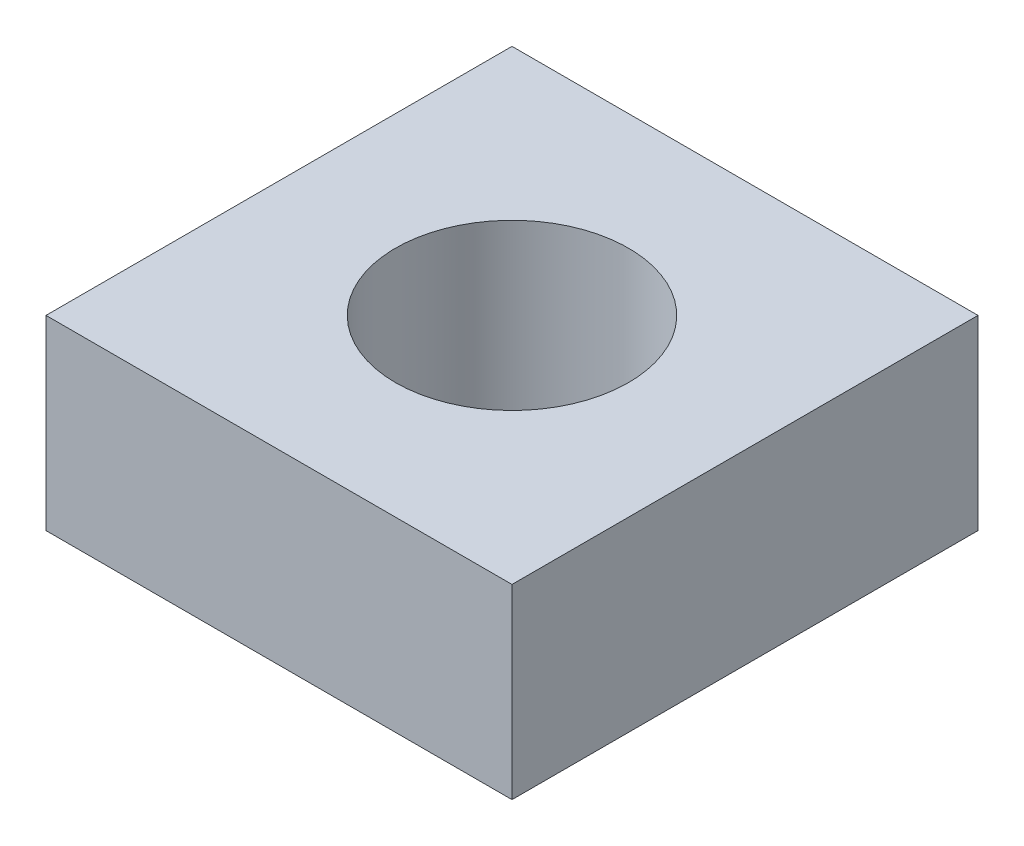
ISO-10303-21;
HEADER;
FILE_DESCRIPTION(('STEP AP214'),'2;1');
FILE_NAME('part.step','',(''),(''),'','','');
FILE_SCHEMA(('AUTOMOTIVE_DESIGN { 1 0 10303 214 1 1 1 1 }'));
ENDSEC;
DATA;
#1=APPLICATION_CONTEXT('core data for automotive mechanical design processes');
#2=APPLICATION_PROTOCOL_DEFINITION('international standard','automotive_design',2000,#1);
#3=PRODUCT_CONTEXT('',#1,'mechanical');
#4=PRODUCT('Part','Part','',(#3));
#5=PRODUCT_RELATED_PRODUCT_CATEGORY('part','',(#4));
#6=PRODUCT_DEFINITION_FORMATION('','',#4);
#7=PRODUCT_DEFINITION_CONTEXT('part definition',#1,'design');
#8=PRODUCT_DEFINITION('design','',#6,#7);
#9=PRODUCT_DEFINITION_SHAPE('','',#8);
#10=(LENGTH_UNIT() NAMED_UNIT(*) SI_UNIT(.MILLI.,.METRE.));
#11=(NAMED_UNIT(*) PLANE_ANGLE_UNIT() SI_UNIT($,.RADIAN.));
#12=(NAMED_UNIT(*) SI_UNIT($,.STERADIAN.) SOLID_ANGLE_UNIT());
#13=UNCERTAINTY_MEASURE_WITH_UNIT(LENGTH_MEASURE(1.E-05),#10,'distance_accuracy_value','');
#14=(GEOMETRIC_REPRESENTATION_CONTEXT(3) GLOBAL_UNCERTAINTY_ASSIGNED_CONTEXT((#13)) GLOBAL_UNIT_ASSIGNED_CONTEXT((#10,
#11,#12)) REPRESENTATION_CONTEXT('',''));
#15=CARTESIAN_POINT('',(0.,0.,0.));
#16=DIRECTION('',(0.,0.,1.));
#17=DIRECTION('',(1.,0.,0.));
#18=AXIS2_PLACEMENT_3D('',#15,#16,#17);
#19=CARTESIAN_POINT('',(0.,20.,0.));
#20=DIRECTION('',(0.,-1.,0.));
#21=DIRECTION('',(0.,0.,-1.));
#22=AXIS2_PLACEMENT_3D('',#19,#20,#21);
#23=PLANE('',#22);
#24=DIRECTION('',(0.,0.,-1.));
#25=VECTOR('',#24,1.);
#26=CARTESIAN_POINT('',(25.,20.,25.));
#27=LINE('',#26,#25);
#28=CARTESIAN_POINT('',(25.,20.,25.));
#29=VERTEX_POINT('',#28);
#30=CARTESIAN_POINT('',(25.,20.,-25.));
#31=VERTEX_POINT('',#30);
#32=EDGE_CURVE('E85',#29,#31,#27,.T.);
#33=ORIENTED_EDGE('',*,*,#32,.T.);
#34=DIRECTION('',(-1.,0.,0.));
#35=VECTOR('',#34,1.);
#36=CARTESIAN_POINT('',(-25.,20.,-25.));
#37=LINE('',#36,#35);
#38=CARTESIAN_POINT('',(-25.,20.,-25.));
#39=VERTEX_POINT('',#38);
#40=EDGE_CURVE('E80',#31,#39,#37,.T.);
#41=ORIENTED_EDGE('',*,*,#40,.T.);
#42=DIRECTION('',(0.,0.,1.));
#43=VECTOR('',#42,1.);
#44=CARTESIAN_POINT('',(-25.,20.,25.));
#45=LINE('',#44,#43);
#46=CARTESIAN_POINT('',(-25.,20.,25.));
#47=VERTEX_POINT('',#46);
#48=EDGE_CURVE('E83',#39,#47,#45,.T.);
#49=ORIENTED_EDGE('',*,*,#48,.T.);
#50=DIRECTION('',(1.,0.,0.));
#51=VECTOR('',#50,1.);
#52=CARTESIAN_POINT('',(-25.,20.,25.));
#53=LINE('',#52,#51);
#54=EDGE_CURVE('E50',#47,#29,#53,.T.);
#55=ORIENTED_EDGE('',*,*,#54,.T.);
#56=EDGE_LOOP('',(#33,#41,#49,#55));
#57=FACE_BOUND('',#56,.T.);
#58=CARTESIAN_POINT('',(0.,20.,0.));
#59=DIRECTION('',(0.,1.,0.));
#60=DIRECTION('',(0.,0.,1.));
#61=AXIS2_PLACEMENT_3D('',#58,#59,#60);
#62=CIRCLE('',#61,12.5);
#63=CARTESIAN_POINT('',(0.,20.,12.5));
#64=VERTEX_POINT('',#63);
#65=EDGE_CURVE('E100',#64,#64,#62,.T.);
#66=ORIENTED_EDGE('',*,*,#65,.F.);
#67=EDGE_LOOP('',(#66));
#68=FACE_BOUND('',#67,.T.);
#69=ADVANCED_FACE('F33',(#57,#68),#23,.F.);
#70=CARTESIAN_POINT('',(0.,0.,0.));
#71=DIRECTION('',(0.,-1.,0.));
#72=DIRECTION('',(0.,0.,-1.));
#73=AXIS2_PLACEMENT_3D('',#70,#71,#72);
#74=PLANE('',#73);
#75=DIRECTION('',(0.,0.,-1.));
#76=VECTOR('',#75,1.);
#77=CARTESIAN_POINT('',(25.,0.,25.));
#78=LINE('',#77,#76);
#79=CARTESIAN_POINT('',(25.,0.,25.));
#80=VERTEX_POINT('',#79);
#81=CARTESIAN_POINT('',(25.,0.,-25.));
#82=VERTEX_POINT('',#81);
#83=EDGE_CURVE('E97',#80,#82,#78,.T.);
#84=ORIENTED_EDGE('',*,*,#83,.F.);
#85=DIRECTION('',(1.,0.,0.));
#86=VECTOR('',#85,1.);
#87=CARTESIAN_POINT('',(-25.,0.,25.));
#88=LINE('',#87,#86);
#89=CARTESIAN_POINT('',(-25.,0.,25.));
#90=VERTEX_POINT('',#89);
#91=EDGE_CURVE('E73',#90,#80,#88,.T.);
#92=ORIENTED_EDGE('',*,*,#91,.F.);
#93=DIRECTION('',(0.,0.,1.));
#94=VECTOR('',#93,1.);
#95=CARTESIAN_POINT('',(-25.,0.,25.));
#96=LINE('',#95,#94);
#97=CARTESIAN_POINT('',(-25.,0.,-25.));
#98=VERTEX_POINT('',#97);
#99=EDGE_CURVE('E67',#98,#90,#96,.T.);
#100=ORIENTED_EDGE('',*,*,#99,.F.);
#101=DIRECTION('',(-1.,0.,0.));
#102=VECTOR('',#101,1.);
#103=CARTESIAN_POINT('',(-25.,0.,-25.));
#104=LINE('',#103,#102);
#105=EDGE_CURVE('E89',#82,#98,#104,.T.);
#106=ORIENTED_EDGE('',*,*,#105,.F.);
#107=EDGE_LOOP('',(#84,#92,#100,#106));
#108=FACE_BOUND('',#107,.T.);
#109=CARTESIAN_POINT('',(0.,0.,0.));
#110=DIRECTION('',(0.,1.,0.));
#111=DIRECTION('',(0.,0.,1.));
#112=AXIS2_PLACEMENT_3D('',#109,#110,#111);
#113=CIRCLE('',#112,12.5);
#114=CARTESIAN_POINT('',(0.,0.,12.5));
#115=VERTEX_POINT('',#114);
#116=EDGE_CURVE('E112',#115,#115,#113,.T.);
#117=ORIENTED_EDGE('',*,*,#116,.T.);
#118=EDGE_LOOP('',(#117));
#119=FACE_BOUND('',#118,.T.);
#120=ADVANCED_FACE('F108',(#108,#119),#74,.T.);
#121=CARTESIAN_POINT('',(25.,20.,25.));
#122=DIRECTION('',(-1.,0.,0.));
#123=DIRECTION('',(0.,0.,1.));
#124=AXIS2_PLACEMENT_3D('',#121,#122,#123);
#125=PLANE('',#124);
#126=ORIENTED_EDGE('',*,*,#83,.T.);
#127=DIRECTION('',(0.,-1.,0.));
#128=VECTOR('',#127,1.);
#129=CARTESIAN_POINT('',(25.,20.,-25.));
#130=LINE('',#129,#128);
#131=EDGE_CURVE('E11',#31,#82,#130,.T.);
#132=ORIENTED_EDGE('',*,*,#131,.F.);
#133=ORIENTED_EDGE('',*,*,#32,.F.);
#134=DIRECTION('',(0.,-1.,0.));
#135=VECTOR('',#134,1.);
#136=CARTESIAN_POINT('',(25.,20.,25.));
#137=LINE('',#136,#135);
#138=EDGE_CURVE('E93',#29,#80,#137,.T.);
#139=ORIENTED_EDGE('',*,*,#138,.T.);
#140=EDGE_LOOP('',(#126,#132,#133,#139));
#141=FACE_BOUND('',#140,.T.);
#142=ADVANCED_FACE('F35',(#141),#125,.F.);
#143=CARTESIAN_POINT('',(-25.,20.,-25.));
#144=DIRECTION('',(0.,0.,1.));
#145=DIRECTION('',(1.,0.,0.));
#146=AXIS2_PLACEMENT_3D('',#143,#144,#145);
#147=PLANE('',#146);
#148=ORIENTED_EDGE('',*,*,#105,.T.);
#149=DIRECTION('',(0.,-1.,0.));
#150=VECTOR('',#149,1.);
#151=CARTESIAN_POINT('',(-25.,20.,-25.));
#152=LINE('',#151,#150);
#153=EDGE_CURVE('E42',#39,#98,#152,.T.);
#154=ORIENTED_EDGE('',*,*,#153,.F.);
#155=ORIENTED_EDGE('',*,*,#40,.F.);
#156=ORIENTED_EDGE('',*,*,#131,.T.);
#157=EDGE_LOOP('',(#148,#154,#155,#156));
#158=FACE_BOUND('',#157,.T.);
#159=ADVANCED_FACE('F88',(#158),#147,.F.);
#160=CARTESIAN_POINT('',(-25.,20.,25.));
#161=DIRECTION('',(1.,0.,0.));
#162=DIRECTION('',(0.,0.,-1.));
#163=AXIS2_PLACEMENT_3D('',#160,#161,#162);
#164=PLANE('',#163);
#165=ORIENTED_EDGE('',*,*,#99,.T.);
#166=DIRECTION('',(0.,-1.,0.));
#167=VECTOR('',#166,1.);
#168=CARTESIAN_POINT('',(-25.,20.,25.));
#169=LINE('',#168,#167);
#170=EDGE_CURVE('E90',#47,#90,#169,.T.);
#171=ORIENTED_EDGE('',*,*,#170,.F.);
#172=ORIENTED_EDGE('',*,*,#48,.F.);
#173=ORIENTED_EDGE('',*,*,#153,.T.);
#174=EDGE_LOOP('',(#165,#171,#172,#173));
#175=FACE_BOUND('',#174,.T.);
#176=ADVANCED_FACE('F91',(#175),#164,.F.);
#177=CARTESIAN_POINT('',(-25.,20.,25.));
#178=DIRECTION('',(0.,0.,-1.));
#179=DIRECTION('',(-1.,0.,0.));
#180=AXIS2_PLACEMENT_3D('',#177,#178,#179);
#181=PLANE('',#180);
#182=ORIENTED_EDGE('',*,*,#91,.T.);
#183=ORIENTED_EDGE('',*,*,#138,.F.);
#184=ORIENTED_EDGE('',*,*,#54,.F.);
#185=ORIENTED_EDGE('',*,*,#170,.T.);
#186=EDGE_LOOP('',(#182,#183,#184,#185));
#187=FACE_BOUND('',#186,.T.);
#188=ADVANCED_FACE('F105',(#187),#181,.F.);
#189=CARTESIAN_POINT('',(0.,20.,0.));
#190=DIRECTION('',(0.,-1.,0.));
#191=DIRECTION('',(0.,0.,-1.));
#192=AXIS2_PLACEMENT_3D('',#189,#190,#191);
#193=CYLINDRICAL_SURFACE('',#192,12.5);
#194=ORIENTED_EDGE('',*,*,#65,.T.);
#195=EDGE_LOOP('',(#194));
#196=FACE_BOUND('',#195,.T.);
#197=ORIENTED_EDGE('',*,*,#116,.F.);
#198=EDGE_LOOP('',(#197));
#199=FACE_BOUND('',#198,.T.);
#200=ADVANCED_FACE('F118',(#196,#199),#193,.F.);
#201=CLOSED_SHELL('',(#69,#120,#142,#159,#176,#188,#200));
#202=MANIFOLD_SOLID_BREP('B2',#201);
#203=ADVANCED_BREP_SHAPE_REPRESENTATION('',(#18,#202),#14);
#204=SHAPE_DEFINITION_REPRESENTATION(#9,#203);
ENDSEC;
END-ISO-10303-21;
